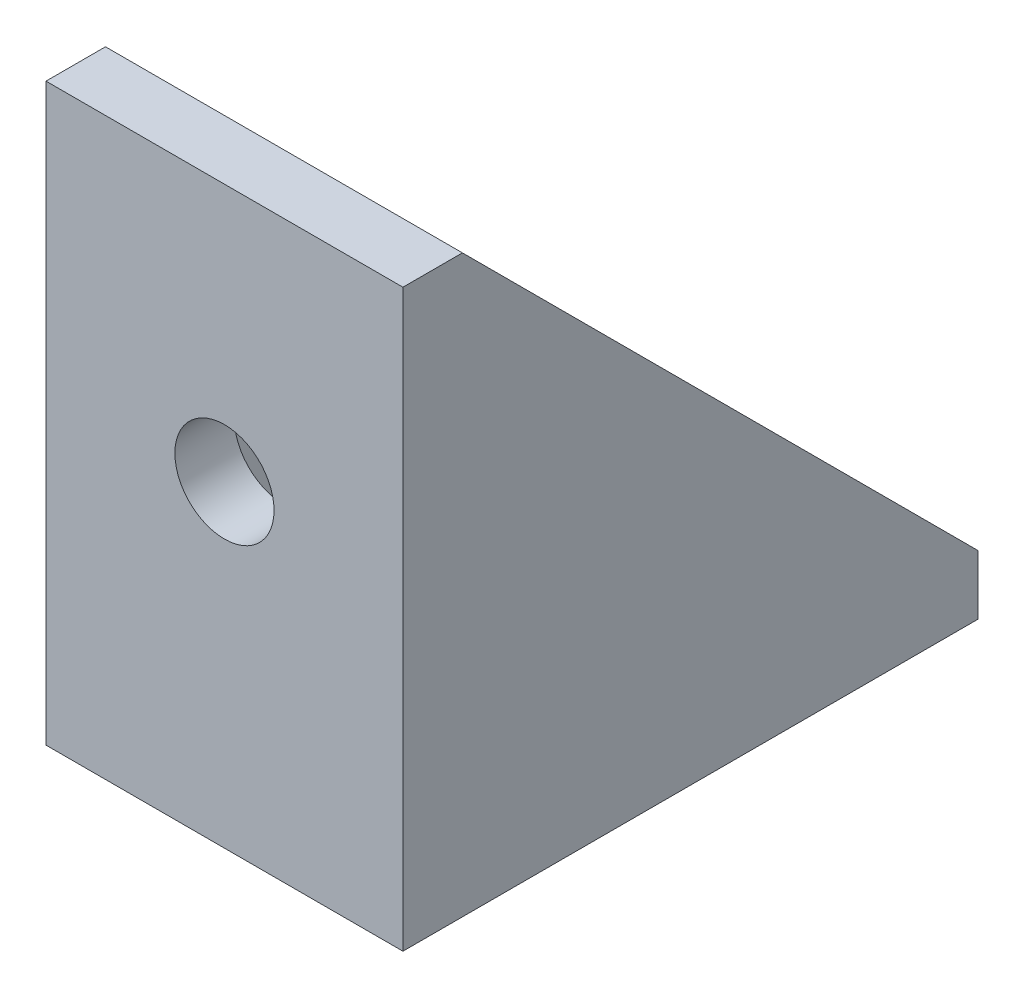
ISO-10303-21;
HEADER;
FILE_DESCRIPTION(('STEP AP214'),'2;1');
FILE_NAME('part.step','',(''),(''),'','','');
FILE_SCHEMA(('AUTOMOTIVE_DESIGN { 1 0 10303 214 1 1 1 1 }'));
ENDSEC;
DATA;
#1=APPLICATION_CONTEXT('core data for automotive mechanical design processes');
#2=APPLICATION_PROTOCOL_DEFINITION('international standard','automotive_design',2000,#1);
#3=PRODUCT_CONTEXT('',#1,'mechanical');
#4=PRODUCT('Part','Part','',(#3));
#5=PRODUCT_RELATED_PRODUCT_CATEGORY('part','',(#4));
#6=PRODUCT_DEFINITION_FORMATION('','',#4);
#7=PRODUCT_DEFINITION_CONTEXT('part definition',#1,'design');
#8=PRODUCT_DEFINITION('design','',#6,#7);
#9=PRODUCT_DEFINITION_SHAPE('','',#8);
#10=(LENGTH_UNIT() NAMED_UNIT(*) SI_UNIT(.MILLI.,.METRE.));
#11=(NAMED_UNIT(*) PLANE_ANGLE_UNIT() SI_UNIT($,.RADIAN.));
#12=(NAMED_UNIT(*) SI_UNIT($,.STERADIAN.) SOLID_ANGLE_UNIT());
#13=UNCERTAINTY_MEASURE_WITH_UNIT(LENGTH_MEASURE(1.E-05),#10,'distance_accuracy_value','');
#14=(GEOMETRIC_REPRESENTATION_CONTEXT(3) GLOBAL_UNCERTAINTY_ASSIGNED_CONTEXT((#13)) GLOBAL_UNIT_ASSIGNED_CONTEXT((#10,
#11,#12)) REPRESENTATION_CONTEXT('',''));
#15=CARTESIAN_POINT('',(0.,0.,0.));
#16=DIRECTION('',(0.,0.,1.));
#17=DIRECTION('',(1.,0.,0.));
#18=AXIS2_PLACEMENT_3D('',#15,#16,#17);
#19=CARTESIAN_POINT('',(-9.,29.,-3.));
#20=DIRECTION('',(0.,0.,1.));
#21=DIRECTION('',(0.,-1.,0.));
#22=AXIS2_PLACEMENT_3D('',#19,#20,#21);
#23=PLANE('',#22);
#24=CARTESIAN_POINT('',(0.,16.,-3.));
#25=DIRECTION('',(0.,0.,-1.));
#26=DIRECTION('',(0.,1.,0.));
#27=AXIS2_PLACEMENT_3D('',#24,#25,#26);
#28=CIRCLE('',#27,2.5);
#29=CARTESIAN_POINT('',(0.,18.5,-3.));
#30=VERTEX_POINT('',#29);
#31=EDGE_CURVE('E143',#30,#30,#28,.T.);
#32=ORIENTED_EDGE('',*,*,#31,.F.);
#33=EDGE_LOOP('',(#32));
#34=FACE_BOUND('',#33,.T.);
#35=DIRECTION('',(0.,-1.,0.));
#36=VECTOR('',#35,1.);
#37=CARTESIAN_POINT('',(-7.,29.,-3.));
#38=LINE('',#37,#36);
#39=CARTESIAN_POINT('',(-7.,29.,-3.));
#40=VERTEX_POINT('',#39);
#41=CARTESIAN_POINT('',(-7.,3.,-3.));
#42=VERTEX_POINT('',#41);
#43=EDGE_CURVE('E147',#40,#42,#38,.T.);
#44=ORIENTED_EDGE('',*,*,#43,.F.);
#45=DIRECTION('',(1.,0.,0.));
#46=VECTOR('',#45,1.);
#47=CARTESIAN_POINT('',(-9.,29.,-3.));
#48=LINE('',#47,#46);
#49=CARTESIAN_POINT('',(7.,29.,-3.));
#50=VERTEX_POINT('',#49);
#51=EDGE_CURVE('E49',#40,#50,#48,.T.);
#52=ORIENTED_EDGE('',*,*,#51,.T.);
#53=DIRECTION('',(0.,1.,0.));
#54=VECTOR('',#53,1.);
#55=CARTESIAN_POINT('',(7.,29.,-3.));
#56=LINE('',#55,#54);
#57=CARTESIAN_POINT('',(7.,3.,-3.));
#58=VERTEX_POINT('',#57);
#59=EDGE_CURVE('E163',#58,#50,#56,.T.);
#60=ORIENTED_EDGE('',*,*,#59,.F.);
#61=DIRECTION('',(1.,0.,0.));
#62=VECTOR('',#61,1.);
#63=CARTESIAN_POINT('',(-9.,3.,-3.));
#64=LINE('',#63,#62);
#65=EDGE_CURVE('E57',#42,#58,#64,.T.);
#66=ORIENTED_EDGE('',*,*,#65,.F.);
#67=EDGE_LOOP('',(#44,#52,#60,#66));
#68=FACE_BOUND('',#67,.T.);
#69=ADVANCED_FACE('F32',(#34,#68),#23,.F.);
#70=CARTESIAN_POINT('',(-9.,3.,0.));
#71=DIRECTION('',(0.,-1.,0.));
#72=DIRECTION('',(0.,0.,-1.));
#73=AXIS2_PLACEMENT_3D('',#70,#71,#72);
#74=PLANE('',#73);
#75=CARTESIAN_POINT('',(0.,3.,-16.));
#76=DIRECTION('',(0.,1.,0.));
#77=DIRECTION('',(0.,0.,1.));
#78=AXIS2_PLACEMENT_3D('',#75,#76,#77);
#79=CIRCLE('',#78,2.5);
#80=CARTESIAN_POINT('',(0.,3.,-13.5));
#81=VERTEX_POINT('',#80);
#82=EDGE_CURVE('E134',#81,#81,#79,.T.);
#83=ORIENTED_EDGE('',*,*,#82,.F.);
#84=EDGE_LOOP('',(#83));
#85=FACE_BOUND('',#84,.T.);
#86=DIRECTION('',(0.,0.,-1.));
#87=VECTOR('',#86,1.);
#88=CARTESIAN_POINT('',(-7.,3.,0.));
#89=LINE('',#88,#87);
#90=CARTESIAN_POINT('',(-7.,3.,-29.));
#91=VERTEX_POINT('',#90);
#92=EDGE_CURVE('E111',#42,#91,#89,.T.);
#93=ORIENTED_EDGE('',*,*,#92,.F.);
#94=ORIENTED_EDGE('',*,*,#65,.T.);
#95=DIRECTION('',(0.,0.,1.));
#96=VECTOR('',#95,1.);
#97=CARTESIAN_POINT('',(7.,3.,0.));
#98=LINE('',#97,#96);
#99=CARTESIAN_POINT('',(7.,3.,-29.));
#100=VERTEX_POINT('',#99);
#101=EDGE_CURVE('E160',#100,#58,#98,.T.);
#102=ORIENTED_EDGE('',*,*,#101,.F.);
#103=DIRECTION('',(1.,0.,0.));
#104=VECTOR('',#103,1.);
#105=CARTESIAN_POINT('',(-9.,3.,-29.));
#106=LINE('',#105,#104);
#107=EDGE_CURVE('E130',#91,#100,#106,.T.);
#108=ORIENTED_EDGE('',*,*,#107,.F.);
#109=EDGE_LOOP('',(#93,#94,#102,#108));
#110=FACE_BOUND('',#109,.T.);
#111=ADVANCED_FACE('F202',(#85,#110),#74,.F.);
#112=CARTESIAN_POINT('',(-9.,0.,0.));
#113=DIRECTION('',(0.,-1.,0.));
#114=DIRECTION('',(0.,0.,-1.));
#115=AXIS2_PLACEMENT_3D('',#112,#113,#114);
#116=PLANE('',#115);
#117=CARTESIAN_POINT('',(0.,0.,-16.));
#118=DIRECTION('',(0.,-1.,0.));
#119=DIRECTION('',(0.,0.,-1.));
#120=AXIS2_PLACEMENT_3D('',#117,#118,#119);
#121=CIRCLE('',#120,2.5);
#122=CARTESIAN_POINT('',(0.,0.,-18.5));
#123=VERTEX_POINT('',#122);
#124=EDGE_CURVE('E132',#123,#123,#121,.T.);
#125=ORIENTED_EDGE('',*,*,#124,.F.);
#126=EDGE_LOOP('',(#125));
#127=FACE_BOUND('',#126,.T.);
#128=DIRECTION('',(1.,0.,0.));
#129=VECTOR('',#128,1.);
#130=CARTESIAN_POINT('',(-9.,0.,-29.));
#131=LINE('',#130,#129);
#132=CARTESIAN_POINT('',(-9.,0.,-29.));
#133=VERTEX_POINT('',#132);
#134=CARTESIAN_POINT('',(9.,0.,-29.));
#135=VERTEX_POINT('',#134);
#136=EDGE_CURVE('E131',#133,#135,#131,.T.);
#137=ORIENTED_EDGE('',*,*,#136,.T.);
#138=DIRECTION('',(0.,0.,-1.));
#139=VECTOR('',#138,1.);
#140=CARTESIAN_POINT('',(9.,0.,0.));
#141=LINE('',#140,#139);
#142=CARTESIAN_POINT('',(9.,0.,0.));
#143=VERTEX_POINT('',#142);
#144=EDGE_CURVE('E166',#143,#135,#141,.T.);
#145=ORIENTED_EDGE('',*,*,#144,.F.);
#146=DIRECTION('',(1.,0.,0.));
#147=VECTOR('',#146,1.);
#148=CARTESIAN_POINT('',(-9.,0.,0.));
#149=LINE('',#148,#147);
#150=CARTESIAN_POINT('',(-9.,0.,0.));
#151=VERTEX_POINT('',#150);
#152=EDGE_CURVE('E11',#151,#143,#149,.T.);
#153=ORIENTED_EDGE('',*,*,#152,.F.);
#154=DIRECTION('',(0.,0.,-1.));
#155=VECTOR('',#154,1.);
#156=CARTESIAN_POINT('',(-9.,0.,0.));
#157=LINE('',#156,#155);
#158=EDGE_CURVE('E177',#151,#133,#157,.T.);
#159=ORIENTED_EDGE('',*,*,#158,.T.);
#160=EDGE_LOOP('',(#137,#145,#153,#159));
#161=FACE_BOUND('',#160,.T.);
#162=ADVANCED_FACE('F34',(#127,#161),#116,.T.);
#163=CARTESIAN_POINT('',(-9.,29.,0.));
#164=DIRECTION('',(0.,0.,1.));
#165=DIRECTION('',(0.,-1.,0.));
#166=AXIS2_PLACEMENT_3D('',#163,#164,#165);
#167=PLANE('',#166);
#168=CARTESIAN_POINT('',(0.,16.,0.));
#169=DIRECTION('',(0.,0.,1.));
#170=DIRECTION('',(0.,-1.,0.));
#171=AXIS2_PLACEMENT_3D('',#168,#169,#170);
#172=CIRCLE('',#171,2.5);
#173=CARTESIAN_POINT('',(0.,13.5,0.));
#174=VERTEX_POINT('',#173);
#175=EDGE_CURVE('E36',#174,#174,#172,.T.);
#176=ORIENTED_EDGE('',*,*,#175,.F.);
#177=EDGE_LOOP('',(#176));
#178=FACE_BOUND('',#177,.T.);
#179=ORIENTED_EDGE('',*,*,#152,.T.);
#180=DIRECTION('',(0.,-1.,0.));
#181=VECTOR('',#180,1.);
#182=CARTESIAN_POINT('',(9.,29.,0.));
#183=LINE('',#182,#181);
#184=CARTESIAN_POINT('',(9.,29.,0.));
#185=VERTEX_POINT('',#184);
#186=EDGE_CURVE('E174',#185,#143,#183,.T.);
#187=ORIENTED_EDGE('',*,*,#186,.F.);
#188=DIRECTION('',(1.,0.,0.));
#189=VECTOR('',#188,1.);
#190=CARTESIAN_POINT('',(-9.,29.,0.));
#191=LINE('',#190,#189);
#192=CARTESIAN_POINT('',(-9.,29.,0.));
#193=VERTEX_POINT('',#192);
#194=EDGE_CURVE('E41',#193,#185,#191,.T.);
#195=ORIENTED_EDGE('',*,*,#194,.F.);
#196=DIRECTION('',(0.,-1.,0.));
#197=VECTOR('',#196,1.);
#198=CARTESIAN_POINT('',(-9.,29.,0.));
#199=LINE('',#198,#197);
#200=EDGE_CURVE('E120',#193,#151,#199,.T.);
#201=ORIENTED_EDGE('',*,*,#200,.T.);
#202=EDGE_LOOP('',(#179,#187,#195,#201));
#203=FACE_BOUND('',#202,.T.);
#204=ADVANCED_FACE('F182',(#178,#203),#167,.T.);
#205=CARTESIAN_POINT('',(-9.,29.,0.));
#206=DIRECTION('',(0.,-1.,0.));
#207=DIRECTION('',(0.,0.,-1.));
#208=AXIS2_PLACEMENT_3D('',#205,#206,#207);
#209=PLANE('',#208);
#210=ORIENTED_EDGE('',*,*,#194,.T.);
#211=DIRECTION('',(0.,0.,-1.));
#212=VECTOR('',#211,1.);
#213=CARTESIAN_POINT('',(9.,29.,0.));
#214=LINE('',#213,#212);
#215=CARTESIAN_POINT('',(9.,29.,-3.));
#216=VERTEX_POINT('',#215);
#217=EDGE_CURVE('E172',#185,#216,#214,.T.);
#218=ORIENTED_EDGE('',*,*,#217,.T.);
#219=DIRECTION('',(1.,0.,0.));
#220=VECTOR('',#219,1.);
#221=CARTESIAN_POINT('',(-9.,29.,-3.));
#222=LINE('',#221,#220);
#223=EDGE_CURVE('E158',#216,#50,#222,.F.);
#224=ORIENTED_EDGE('',*,*,#223,.T.);
#225=ORIENTED_EDGE('',*,*,#51,.F.);
#226=CARTESIAN_POINT('',(-9.,29.,-3.));
#227=VERTEX_POINT('',#226);
#228=EDGE_CURVE('E105',#227,#40,#48,.T.);
#229=ORIENTED_EDGE('',*,*,#228,.F.);
#230=DIRECTION('',(0.,0.,-1.));
#231=VECTOR('',#230,1.);
#232=CARTESIAN_POINT('',(-9.,29.,0.));
#233=LINE('',#232,#231);
#234=EDGE_CURVE('E116',#193,#227,#233,.T.);
#235=ORIENTED_EDGE('',*,*,#234,.F.);
#236=EDGE_LOOP('',(#210,#218,#224,#225,#229,#235));
#237=FACE_BOUND('',#236,.T.);
#238=ADVANCED_FACE('F124',(#237),#209,.F.);
#239=CARTESIAN_POINT('',(-9.,3.,-29.));
#240=DIRECTION('',(0.,0.,1.));
#241=DIRECTION('',(1.,0.,0.));
#242=AXIS2_PLACEMENT_3D('',#239,#240,#241);
#243=PLANE('',#242);
#244=CARTESIAN_POINT('',(-9.,3.,-29.));
#245=VERTEX_POINT('',#244);
#246=EDGE_CURVE('E108',#245,#91,#106,.T.);
#247=ORIENTED_EDGE('',*,*,#246,.T.);
#248=ORIENTED_EDGE('',*,*,#107,.T.);
#249=DIRECTION('',(1.,0.,0.));
#250=VECTOR('',#249,1.);
#251=CARTESIAN_POINT('',(-9.,3.,-29.));
#252=LINE('',#251,#250);
#253=CARTESIAN_POINT('',(9.,3.,-29.));
#254=VERTEX_POINT('',#253);
#255=EDGE_CURVE('E153',#254,#100,#252,.F.);
#256=ORIENTED_EDGE('',*,*,#255,.F.);
#257=DIRECTION('',(0.,-1.,0.));
#258=VECTOR('',#257,1.);
#259=CARTESIAN_POINT('',(9.,3.,-29.));
#260=LINE('',#259,#258);
#261=EDGE_CURVE('E169',#254,#135,#260,.T.);
#262=ORIENTED_EDGE('',*,*,#261,.T.);
#263=ORIENTED_EDGE('',*,*,#136,.F.);
#264=DIRECTION('',(0.,-1.,0.));
#265=VECTOR('',#264,1.);
#266=CARTESIAN_POINT('',(-9.,3.,-29.));
#267=LINE('',#266,#265);
#268=EDGE_CURVE('E122',#245,#133,#267,.T.);
#269=ORIENTED_EDGE('',*,*,#268,.F.);
#270=EDGE_LOOP('',(#247,#248,#256,#262,#263,#269));
#271=FACE_BOUND('',#270,.T.);
#272=ADVANCED_FACE('F196',(#271),#243,.F.);
#273=CARTESIAN_POINT('',(-9.,0.,0.));
#274=DIRECTION('',(-1.,0.,0.));
#275=DIRECTION('',(0.,0.,1.));
#276=AXIS2_PLACEMENT_3D('',#273,#274,#275);
#277=PLANE('',#276);
#278=ORIENTED_EDGE('',*,*,#158,.F.);
#279=ORIENTED_EDGE('',*,*,#200,.F.);
#280=ORIENTED_EDGE('',*,*,#234,.T.);
#281=DIRECTION('',(0.,-0.707106781186548,-0.707106781186547));
#282=VECTOR('',#281,1.);
#283=CARTESIAN_POINT('',(-9.,29.,-3.));
#284=LINE('',#283,#282);
#285=EDGE_CURVE('E100',#227,#245,#284,.T.);
#286=ORIENTED_EDGE('',*,*,#285,.T.);
#287=ORIENTED_EDGE('',*,*,#268,.T.);
#288=EDGE_LOOP('',(#278,#279,#280,#286,#287));
#289=FACE_BOUND('',#288,.T.);
#290=ADVANCED_FACE('F118',(#289),#277,.T.);
#291=CARTESIAN_POINT('',(9.,0.,0.));
#292=DIRECTION('',(-1.,0.,0.));
#293=DIRECTION('',(0.,0.,1.));
#294=AXIS2_PLACEMENT_3D('',#291,#292,#293);
#295=PLANE('',#294);
#296=ORIENTED_EDGE('',*,*,#261,.F.);
#297=DIRECTION('',(0.,-0.707106781186548,-0.707106781186547));
#298=VECTOR('',#297,1.);
#299=CARTESIAN_POINT('',(9.,29.,-3.));
#300=LINE('',#299,#298);
#301=EDGE_CURVE('E150',#216,#254,#300,.T.);
#302=ORIENTED_EDGE('',*,*,#301,.F.);
#303=ORIENTED_EDGE('',*,*,#217,.F.);
#304=ORIENTED_EDGE('',*,*,#186,.T.);
#305=ORIENTED_EDGE('',*,*,#144,.T.);
#306=EDGE_LOOP('',(#296,#302,#303,#304,#305));
#307=FACE_BOUND('',#306,.T.);
#308=ADVANCED_FACE('F192',(#307),#295,.F.);
#309=CARTESIAN_POINT('',(7.,14.5,-14.5));
#310=DIRECTION('',(1.,0.,0.));
#311=DIRECTION('',(0.,0.,-1.));
#312=AXIS2_PLACEMENT_3D('',#309,#310,#311);
#313=PLANE('',#312);
#314=ORIENTED_EDGE('',*,*,#101,.T.);
#315=ORIENTED_EDGE('',*,*,#59,.T.);
#316=DIRECTION('',(0.,-0.707106781186548,-0.707106781186547));
#317=VECTOR('',#316,1.);
#318=CARTESIAN_POINT('',(7.,29.,-3.));
#319=LINE('',#318,#317);
#320=EDGE_CURVE('E149',#50,#100,#319,.T.);
#321=ORIENTED_EDGE('',*,*,#320,.T.);
#322=EDGE_LOOP('',(#314,#315,#321));
#323=FACE_BOUND('',#322,.T.);
#324=ADVANCED_FACE('F199',(#323),#313,.F.);
#325=CARTESIAN_POINT('',(9.,29.,-3.));
#326=DIRECTION('',(0.,-0.707106781186547,0.707106781186548));
#327=DIRECTION('',(0.,-0.707106781186548,-0.707106781186547));
#328=AXIS2_PLACEMENT_3D('',#325,#326,#327);
#329=PLANE('',#328);
#330=ORIENTED_EDGE('',*,*,#223,.F.);
#331=ORIENTED_EDGE('',*,*,#301,.T.);
#332=ORIENTED_EDGE('',*,*,#255,.T.);
#333=ORIENTED_EDGE('',*,*,#320,.F.);
#334=EDGE_LOOP('',(#330,#331,#332,#333));
#335=FACE_BOUND('',#334,.T.);
#336=ADVANCED_FACE('F190',(#335),#329,.F.);
#337=CARTESIAN_POINT('',(-7.,14.5,-14.5));
#338=DIRECTION('',(-1.,0.,0.));
#339=DIRECTION('',(0.,0.,1.));
#340=AXIS2_PLACEMENT_3D('',#337,#338,#339);
#341=PLANE('',#340);
#342=DIRECTION('',(0.,-0.707106781186548,-0.707106781186547));
#343=VECTOR('',#342,1.);
#344=CARTESIAN_POINT('',(-7.,29.,-3.));
#345=LINE('',#344,#343);
#346=EDGE_CURVE('E112',#40,#91,#345,.T.);
#347=ORIENTED_EDGE('',*,*,#346,.F.);
#348=ORIENTED_EDGE('',*,*,#43,.T.);
#349=ORIENTED_EDGE('',*,*,#92,.T.);
#350=EDGE_LOOP('',(#347,#348,#349));
#351=FACE_BOUND('',#350,.T.);
#352=ADVANCED_FACE('F201',(#351),#341,.F.);
#353=CARTESIAN_POINT('',(-9.,29.,-3.));
#354=DIRECTION('',(0.,0.707106781186547,-0.707106781186548));
#355=DIRECTION('',(0.,-0.707106781186548,-0.707106781186547));
#356=AXIS2_PLACEMENT_3D('',#353,#354,#355);
#357=PLANE('',#356);
#358=ORIENTED_EDGE('',*,*,#285,.F.);
#359=ORIENTED_EDGE('',*,*,#228,.T.);
#360=ORIENTED_EDGE('',*,*,#346,.T.);
#361=ORIENTED_EDGE('',*,*,#246,.F.);
#362=EDGE_LOOP('',(#358,#359,#360,#361));
#363=FACE_BOUND('',#362,.T.);
#364=ADVANCED_FACE('F102',(#363),#357,.T.);
#365=CARTESIAN_POINT('',(0.,-7.,-16.));
#366=DIRECTION('',(0.,1.,0.));
#367=DIRECTION('',(0.,0.,1.));
#368=AXIS2_PLACEMENT_3D('',#365,#366,#367);
#369=CYLINDRICAL_SURFACE('',#368,2.5);
#370=ORIENTED_EDGE('',*,*,#124,.T.);
#371=EDGE_LOOP('',(#370));
#372=FACE_BOUND('',#371,.T.);
#373=ORIENTED_EDGE('',*,*,#82,.T.);
#374=EDGE_LOOP('',(#373));
#375=FACE_BOUND('',#374,.T.);
#376=ADVANCED_FACE('F247',(#372,#375),#369,.F.);
#377=CARTESIAN_POINT('',(0.,16.,7.));
#378=DIRECTION('',(0.,0.,-1.));
#379=DIRECTION('',(0.,1.,0.));
#380=AXIS2_PLACEMENT_3D('',#377,#378,#379);
#381=CYLINDRICAL_SURFACE('',#380,2.5);
#382=ORIENTED_EDGE('',*,*,#175,.T.);
#383=EDGE_LOOP('',(#382));
#384=FACE_BOUND('',#383,.T.);
#385=ORIENTED_EDGE('',*,*,#31,.T.);
#386=EDGE_LOOP('',(#385));
#387=FACE_BOUND('',#386,.T.);
#388=ADVANCED_FACE('F243',(#384,#387),#381,.F.);
#389=CLOSED_SHELL('',(#69,#111,#162,#204,#238,#272,#290,#308,#324,#336,#352,#364,#376,#388));
#390=MANIFOLD_SOLID_BREP('B2',#389);
#391=ADVANCED_BREP_SHAPE_REPRESENTATION('',(#18,#390),#14);
#392=SHAPE_DEFINITION_REPRESENTATION(#9,#391);
ENDSEC;
END-ISO-10303-21;
